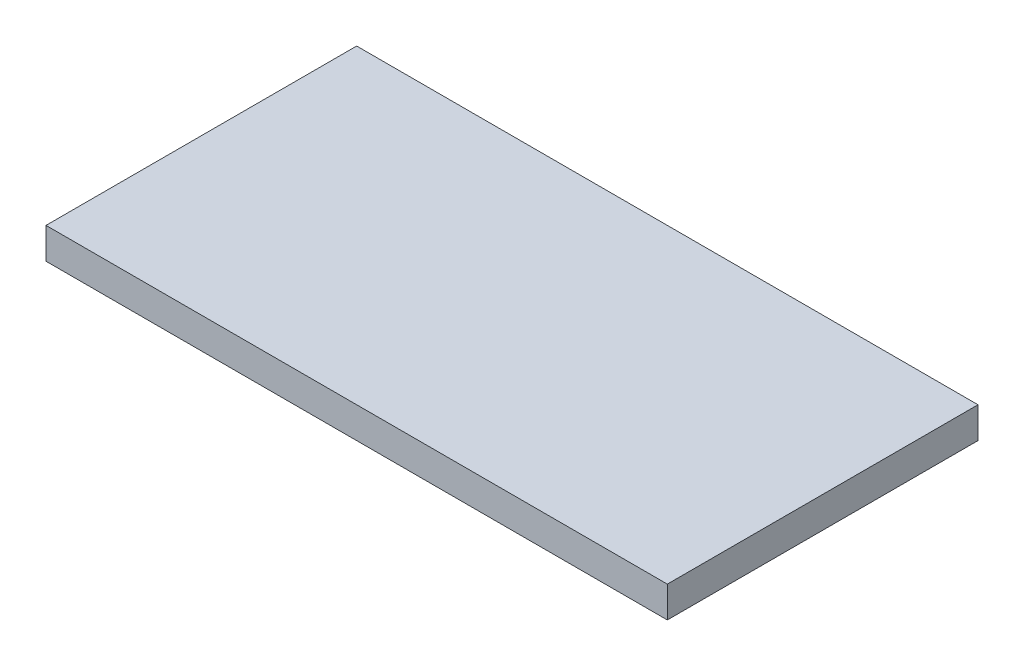
ISO-10303-21;
HEADER;
FILE_DESCRIPTION(('STEP AP214'),'2;1');
FILE_NAME('part.step','',(''),(''),'','','');
FILE_SCHEMA(('AUTOMOTIVE_DESIGN { 1 0 10303 214 1 1 1 1 }'));
ENDSEC;
DATA;
#1=APPLICATION_CONTEXT('core data for automotive mechanical design processes');
#2=APPLICATION_PROTOCOL_DEFINITION('international standard','automotive_design',2000,#1);
#3=PRODUCT_CONTEXT('',#1,'mechanical');
#4=PRODUCT('Part','Part','',(#3));
#5=PRODUCT_RELATED_PRODUCT_CATEGORY('part','',(#4));
#6=PRODUCT_DEFINITION_FORMATION('','',#4);
#7=PRODUCT_DEFINITION_CONTEXT('part definition',#1,'design');
#8=PRODUCT_DEFINITION('design','',#6,#7);
#9=PRODUCT_DEFINITION_SHAPE('','',#8);
#10=(LENGTH_UNIT() NAMED_UNIT(*) SI_UNIT(.MILLI.,.METRE.));
#11=(NAMED_UNIT(*) PLANE_ANGLE_UNIT() SI_UNIT($,.RADIAN.));
#12=(NAMED_UNIT(*) SI_UNIT($,.STERADIAN.) SOLID_ANGLE_UNIT());
#13=UNCERTAINTY_MEASURE_WITH_UNIT(LENGTH_MEASURE(1.E-05),#10,'distance_accuracy_value','');
#14=(GEOMETRIC_REPRESENTATION_CONTEXT(3) GLOBAL_UNCERTAINTY_ASSIGNED_CONTEXT((#13)) GLOBAL_UNIT_ASSIGNED_CONTEXT((#10,
#11,#12)) REPRESENTATION_CONTEXT('',''));
#15=CARTESIAN_POINT('',(0.,0.,0.));
#16=DIRECTION('',(0.,0.,1.));
#17=DIRECTION('',(1.,0.,0.));
#18=AXIS2_PLACEMENT_3D('',#15,#16,#17);
#19=CARTESIAN_POINT('',(500.,50.,250.));
#20=DIRECTION('',(-1.,0.,0.));
#21=DIRECTION('',(0.,0.,1.));
#22=AXIS2_PLACEMENT_3D('',#19,#20,#21);
#23=PLANE('',#22);
#24=DIRECTION('',(0.,0.,-1.));
#25=VECTOR('',#24,1.);
#26=CARTESIAN_POINT('',(500.,0.,250.));
#27=LINE('',#26,#25);
#28=CARTESIAN_POINT('',(500.,0.,250.));
#29=VERTEX_POINT('',#28);
#30=CARTESIAN_POINT('',(500.,0.,-250.));
#31=VERTEX_POINT('',#30);
#32=EDGE_CURVE('E96',#29,#31,#27,.T.);
#33=ORIENTED_EDGE('',*,*,#32,.T.);
#34=DIRECTION('',(0.,-1.,0.));
#35=VECTOR('',#34,1.);
#36=CARTESIAN_POINT('',(500.,50.,-250.));
#37=LINE('',#36,#35);
#38=CARTESIAN_POINT('',(500.,50.,-250.));
#39=VERTEX_POINT('',#38);
#40=EDGE_CURVE('E11',#39,#31,#37,.T.);
#41=ORIENTED_EDGE('',*,*,#40,.F.);
#42=DIRECTION('',(0.,0.,-1.));
#43=VECTOR('',#42,1.);
#44=CARTESIAN_POINT('',(500.,50.,250.));
#45=LINE('',#44,#43);
#46=CARTESIAN_POINT('',(500.,50.,250.));
#47=VERTEX_POINT('',#46);
#48=EDGE_CURVE('E84',#47,#39,#45,.T.);
#49=ORIENTED_EDGE('',*,*,#48,.F.);
#50=DIRECTION('',(0.,-1.,0.));
#51=VECTOR('',#50,1.);
#52=CARTESIAN_POINT('',(500.,50.,250.));
#53=LINE('',#52,#51);
#54=EDGE_CURVE('E92',#47,#29,#53,.T.);
#55=ORIENTED_EDGE('',*,*,#54,.T.);
#56=EDGE_LOOP('',(#33,#41,#49,#55));
#57=FACE_BOUND('',#56,.T.);
#58=ADVANCED_FACE('F33',(#57),#23,.F.);
#59=CARTESIAN_POINT('',(-500.,50.,-250.));
#60=DIRECTION('',(0.,0.,1.));
#61=DIRECTION('',(1.,0.,0.));
#62=AXIS2_PLACEMENT_3D('',#59,#60,#61);
#63=PLANE('',#62);
#64=DIRECTION('',(-1.,0.,0.));
#65=VECTOR('',#64,1.);
#66=CARTESIAN_POINT('',(-500.,0.,-250.));
#67=LINE('',#66,#65);
#68=CARTESIAN_POINT('',(-500.,0.,-250.));
#69=VERTEX_POINT('',#68);
#70=EDGE_CURVE('E88',#31,#69,#67,.T.);
#71=ORIENTED_EDGE('',*,*,#70,.T.);
#72=DIRECTION('',(0.,-1.,0.));
#73=VECTOR('',#72,1.);
#74=CARTESIAN_POINT('',(-500.,50.,-250.));
#75=LINE('',#74,#73);
#76=CARTESIAN_POINT('',(-500.,50.,-250.));
#77=VERTEX_POINT('',#76);
#78=EDGE_CURVE('E41',#77,#69,#75,.T.);
#79=ORIENTED_EDGE('',*,*,#78,.F.);
#80=DIRECTION('',(-1.,0.,0.));
#81=VECTOR('',#80,1.);
#82=CARTESIAN_POINT('',(-500.,50.,-250.));
#83=LINE('',#82,#81);
#84=EDGE_CURVE('E79',#39,#77,#83,.T.);
#85=ORIENTED_EDGE('',*,*,#84,.F.);
#86=ORIENTED_EDGE('',*,*,#40,.T.);
#87=EDGE_LOOP('',(#71,#79,#85,#86));
#88=FACE_BOUND('',#87,.T.);
#89=ADVANCED_FACE('F87',(#88),#63,.F.);
#90=CARTESIAN_POINT('',(-500.,50.,250.));
#91=DIRECTION('',(1.,0.,0.));
#92=DIRECTION('',(0.,0.,-1.));
#93=AXIS2_PLACEMENT_3D('',#90,#91,#92);
#94=PLANE('',#93);
#95=DIRECTION('',(0.,0.,1.));
#96=VECTOR('',#95,1.);
#97=CARTESIAN_POINT('',(-500.,0.,250.));
#98=LINE('',#97,#96);
#99=CARTESIAN_POINT('',(-500.,0.,250.));
#100=VERTEX_POINT('',#99);
#101=EDGE_CURVE('E66',#69,#100,#98,.T.);
#102=ORIENTED_EDGE('',*,*,#101,.T.);
#103=DIRECTION('',(0.,-1.,0.));
#104=VECTOR('',#103,1.);
#105=CARTESIAN_POINT('',(-500.,50.,250.));
#106=LINE('',#105,#104);
#107=CARTESIAN_POINT('',(-500.,50.,250.));
#108=VERTEX_POINT('',#107);
#109=EDGE_CURVE('E89',#108,#100,#106,.T.);
#110=ORIENTED_EDGE('',*,*,#109,.F.);
#111=DIRECTION('',(0.,0.,1.));
#112=VECTOR('',#111,1.);
#113=CARTESIAN_POINT('',(-500.,50.,250.));
#114=LINE('',#113,#112);
#115=EDGE_CURVE('E82',#77,#108,#114,.T.);
#116=ORIENTED_EDGE('',*,*,#115,.F.);
#117=ORIENTED_EDGE('',*,*,#78,.T.);
#118=EDGE_LOOP('',(#102,#110,#116,#117));
#119=FACE_BOUND('',#118,.T.);
#120=ADVANCED_FACE('F90',(#119),#94,.F.);
#121=CARTESIAN_POINT('',(-500.,50.,250.));
#122=DIRECTION('',(0.,0.,-1.));
#123=DIRECTION('',(-1.,0.,0.));
#124=AXIS2_PLACEMENT_3D('',#121,#122,#123);
#125=PLANE('',#124);
#126=DIRECTION('',(1.,0.,0.));
#127=VECTOR('',#126,1.);
#128=CARTESIAN_POINT('',(-500.,0.,250.));
#129=LINE('',#128,#127);
#130=EDGE_CURVE('E72',#100,#29,#129,.T.);
#131=ORIENTED_EDGE('',*,*,#130,.T.);
#132=ORIENTED_EDGE('',*,*,#54,.F.);
#133=DIRECTION('',(1.,0.,0.));
#134=VECTOR('',#133,1.);
#135=CARTESIAN_POINT('',(-500.,50.,250.));
#136=LINE('',#135,#134);
#137=EDGE_CURVE('E49',#108,#47,#136,.T.);
#138=ORIENTED_EDGE('',*,*,#137,.F.);
#139=ORIENTED_EDGE('',*,*,#109,.T.);
#140=EDGE_LOOP('',(#131,#132,#138,#139));
#141=FACE_BOUND('',#140,.T.);
#142=ADVANCED_FACE('F103',(#141),#125,.F.);
#143=CARTESIAN_POINT('',(0.,50.,0.));
#144=DIRECTION('',(0.,-1.,0.));
#145=DIRECTION('',(0.,0.,-1.));
#146=AXIS2_PLACEMENT_3D('',#143,#144,#145);
#147=PLANE('',#146);
#148=ORIENTED_EDGE('',*,*,#48,.T.);
#149=ORIENTED_EDGE('',*,*,#84,.T.);
#150=ORIENTED_EDGE('',*,*,#115,.T.);
#151=ORIENTED_EDGE('',*,*,#137,.T.);
#152=EDGE_LOOP('',(#148,#149,#150,#151));
#153=FACE_BOUND('',#152,.T.);
#154=ADVANCED_FACE('F80',(#153),#147,.F.);
#155=CARTESIAN_POINT('',(0.,0.,0.));
#156=DIRECTION('',(0.,-1.,0.));
#157=DIRECTION('',(0.,0.,-1.));
#158=AXIS2_PLACEMENT_3D('',#155,#156,#157);
#159=PLANE('',#158);
#160=ORIENTED_EDGE('',*,*,#32,.F.);
#161=ORIENTED_EDGE('',*,*,#130,.F.);
#162=ORIENTED_EDGE('',*,*,#101,.F.);
#163=ORIENTED_EDGE('',*,*,#70,.F.);
#164=EDGE_LOOP('',(#160,#161,#162,#163));
#165=FACE_BOUND('',#164,.T.);
#166=ADVANCED_FACE('F106',(#165),#159,.T.);
#167=CLOSED_SHELL('',(#58,#89,#120,#142,#154,#166));
#168=MANIFOLD_SOLID_BREP('B2',#167);
#169=ADVANCED_BREP_SHAPE_REPRESENTATION('',(#18,#168),#14);
#170=SHAPE_DEFINITION_REPRESENTATION(#9,#169);
ENDSEC;
END-ISO-10303-21;
